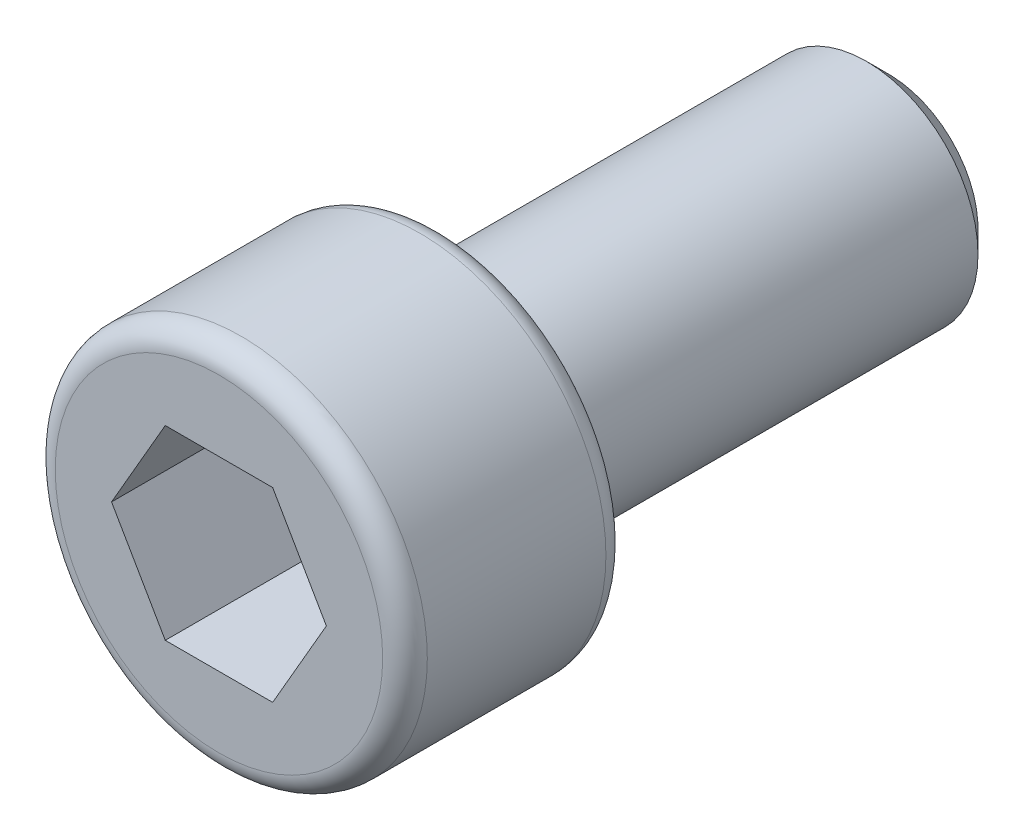
ISO-10303-21;
HEADER;
FILE_DESCRIPTION(('STEP AP214'),'2;1');
FILE_NAME('part.step','',(''),(''),'','','');
FILE_SCHEMA(('AUTOMOTIVE_DESIGN { 1 0 10303 214 1 1 1 1 }'));
ENDSEC;
DATA;
#1=APPLICATION_CONTEXT('core data for automotive mechanical design processes');
#2=APPLICATION_PROTOCOL_DEFINITION('international standard','automotive_design',2000,#1);
#3=PRODUCT_CONTEXT('',#1,'mechanical');
#4=PRODUCT('Part','Part','',(#3));
#5=PRODUCT_RELATED_PRODUCT_CATEGORY('part','',(#4));
#6=PRODUCT_DEFINITION_FORMATION('','',#4);
#7=PRODUCT_DEFINITION_CONTEXT('part definition',#1,'design');
#8=PRODUCT_DEFINITION('design','',#6,#7);
#9=PRODUCT_DEFINITION_SHAPE('','',#8);
#10=(LENGTH_UNIT() NAMED_UNIT(*) SI_UNIT(.MILLI.,.METRE.));
#11=(NAMED_UNIT(*) PLANE_ANGLE_UNIT() SI_UNIT($,.RADIAN.));
#12=(NAMED_UNIT(*) SI_UNIT($,.STERADIAN.) SOLID_ANGLE_UNIT());
#13=UNCERTAINTY_MEASURE_WITH_UNIT(LENGTH_MEASURE(1.E-05),#10,'distance_accuracy_value','');
#14=(GEOMETRIC_REPRESENTATION_CONTEXT(3) GLOBAL_UNCERTAINTY_ASSIGNED_CONTEXT((#13)) GLOBAL_UNIT_ASSIGNED_CONTEXT((#10,
#11,#12)) REPRESENTATION_CONTEXT('',''));
#15=CARTESIAN_POINT('',(0.,0.,0.));
#16=DIRECTION('',(0.,0.,1.));
#17=DIRECTION('',(1.,0.,0.));
#18=AXIS2_PLACEMENT_3D('',#15,#16,#17);
#19=CARTESIAN_POINT('',(0.,0.,3.));
#20=DIRECTION('',(0.,0.,-1.));
#21=DIRECTION('',(-1.,0.,0.));
#22=AXIS2_PLACEMENT_3D('',#19,#20,#21);
#23=CYLINDRICAL_SURFACE('',#22,2.5);
#24=CARTESIAN_POINT('',(0.,0.,0.3));
#25=DIRECTION('',(0.,0.,1.));
#26=DIRECTION('',(1.,0.,0.));
#27=AXIS2_PLACEMENT_3D('',#24,#25,#26);
#28=CIRCLE('',#27,2.5);
#29=CARTESIAN_POINT('',(2.5,0.,0.3));
#30=VERTEX_POINT('',#29);
#31=EDGE_CURVE('E154',#30,#30,#28,.T.);
#32=ORIENTED_EDGE('',*,*,#31,.T.);
#33=EDGE_LOOP('',(#32));
#34=FACE_BOUND('',#33,.T.);
#35=CARTESIAN_POINT('',(0.,0.,2.7));
#36=DIRECTION('',(0.,0.,1.));
#37=DIRECTION('',(1.,0.,0.));
#38=AXIS2_PLACEMENT_3D('',#35,#36,#37);
#39=CIRCLE('',#38,2.5);
#40=CARTESIAN_POINT('',(2.5,0.,2.7));
#41=VERTEX_POINT('',#40);
#42=EDGE_CURVE('E151',#41,#41,#39,.F.);
#43=ORIENTED_EDGE('',*,*,#42,.T.);
#44=EDGE_LOOP('',(#43));
#45=FACE_BOUND('',#44,.T.);
#46=ADVANCED_FACE('F35',(#34,#45),#23,.T.);
#47=CARTESIAN_POINT('',(0.,0.,3.));
#48=DIRECTION('',(0.,0.,1.));
#49=DIRECTION('',(1.,0.,0.));
#50=AXIS2_PLACEMENT_3D('',#47,#48,#49);
#51=PLANE('',#50);
#52=CARTESIAN_POINT('',(0.,0.,3.));
#53=DIRECTION('',(0.,0.,1.));
#54=DIRECTION('',(1.,0.,0.));
#55=AXIS2_PLACEMENT_3D('',#52,#53,#54);
#56=CIRCLE('',#55,2.2);
#57=CARTESIAN_POINT('',(2.2,0.,3.));
#58=VERTEX_POINT('',#57);
#59=EDGE_CURVE('E11',#58,#58,#56,.T.);
#60=ORIENTED_EDGE('',*,*,#59,.T.);
#61=EDGE_LOOP('',(#60));
#62=FACE_BOUND('',#61,.T.);
#63=DIRECTION('',(0.5,0.866025403784439,0.));
#64=VECTOR('',#63,1.);
#65=CARTESIAN_POINT('',(0.721687836487033,-1.25,3.));
#66=LINE('',#65,#64);
#67=CARTESIAN_POINT('',(0.721687836487033,-1.25,3.));
#68=VERTEX_POINT('',#67);
#69=CARTESIAN_POINT('',(1.44337567297406,0.,3.));
#70=VERTEX_POINT('',#69);
#71=EDGE_CURVE('E50',#68,#70,#66,.T.);
#72=ORIENTED_EDGE('',*,*,#71,.F.);
#73=DIRECTION('',(1.,0.,0.));
#74=VECTOR('',#73,1.);
#75=CARTESIAN_POINT('',(-0.721687836487032,-1.25,3.));
#76=LINE('',#75,#74);
#77=CARTESIAN_POINT('',(-0.721687836487032,-1.25,3.));
#78=VERTEX_POINT('',#77);
#79=EDGE_CURVE('E133',#78,#68,#76,.T.);
#80=ORIENTED_EDGE('',*,*,#79,.F.);
#81=DIRECTION('',(0.5,-0.866025403784438,0.));
#82=VECTOR('',#81,1.);
#83=CARTESIAN_POINT('',(-1.44337567297406,0.,3.));
#84=LINE('',#83,#82);
#85=CARTESIAN_POINT('',(-1.44337567297406,0.,3.));
#86=VERTEX_POINT('',#85);
#87=EDGE_CURVE('E131',#86,#78,#84,.T.);
#88=ORIENTED_EDGE('',*,*,#87,.F.);
#89=DIRECTION('',(-0.5,-0.866025403784439,0.));
#90=VECTOR('',#89,1.);
#91=CARTESIAN_POINT('',(-0.721687836487032,1.25,3.));
#92=LINE('',#91,#90);
#93=CARTESIAN_POINT('',(-0.721687836487032,1.25,3.));
#94=VERTEX_POINT('',#93);
#95=EDGE_CURVE('E98',#94,#86,#92,.T.);
#96=ORIENTED_EDGE('',*,*,#95,.F.);
#97=DIRECTION('',(-1.,0.,0.));
#98=VECTOR('',#97,1.);
#99=CARTESIAN_POINT('',(0.721687836487032,1.25,3.));
#100=LINE('',#99,#98);
#101=CARTESIAN_POINT('',(0.721687836487032,1.25,3.));
#102=VERTEX_POINT('',#101);
#103=EDGE_CURVE('E127',#102,#94,#100,.T.);
#104=ORIENTED_EDGE('',*,*,#103,.F.);
#105=DIRECTION('',(-0.5,0.866025403784439,0.));
#106=VECTOR('',#105,1.);
#107=CARTESIAN_POINT('',(1.44337567297406,0.,3.));
#108=LINE('',#107,#106);
#109=EDGE_CURVE('E124',#70,#102,#108,.T.);
#110=ORIENTED_EDGE('',*,*,#109,.F.);
#111=EDGE_LOOP('',(#72,#80,#88,#96,#104,#110));
#112=FACE_BOUND('',#111,.T.);
#113=ADVANCED_FACE('F170',(#62,#112),#51,.T.);
#114=CARTESIAN_POINT('',(0.,0.,0.));
#115=DIRECTION('',(0.,0.,1.));
#116=DIRECTION('',(1.,0.,0.));
#117=AXIS2_PLACEMENT_3D('',#114,#115,#116);
#118=PLANE('',#117);
#119=CARTESIAN_POINT('',(0.,0.,0.));
#120=DIRECTION('',(0.,0.,1.));
#121=DIRECTION('',(1.,0.,0.));
#122=AXIS2_PLACEMENT_3D('',#119,#120,#121);
#123=CIRCLE('',#122,2.2);
#124=CARTESIAN_POINT('',(2.2,0.,0.));
#125=VERTEX_POINT('',#124);
#126=EDGE_CURVE('E43',#125,#125,#123,.F.);
#127=ORIENTED_EDGE('',*,*,#126,.T.);
#128=EDGE_LOOP('',(#127));
#129=FACE_BOUND('',#128,.T.);
#130=CARTESIAN_POINT('',(0.,0.,0.));
#131=DIRECTION('',(0.,0.,-1.));
#132=DIRECTION('',(-1.,0.,0.));
#133=AXIS2_PLACEMENT_3D('',#130,#131,#132);
#134=CIRCLE('',#133,1.5);
#135=CARTESIAN_POINT('',(-1.5,0.,0.));
#136=VERTEX_POINT('',#135);
#137=EDGE_CURVE('E137',#136,#136,#134,.T.);
#138=ORIENTED_EDGE('',*,*,#137,.F.);
#139=EDGE_LOOP('',(#138));
#140=FACE_BOUND('',#139,.T.);
#141=ADVANCED_FACE('F159',(#129,#140),#118,.F.);
#142=CARTESIAN_POINT('',(0.,0.,-6.));
#143=DIRECTION('',(0.,0.,1.));
#144=DIRECTION('',(1.,0.,0.));
#145=AXIS2_PLACEMENT_3D('',#142,#143,#144);
#146=CYLINDRICAL_SURFACE('',#145,1.5);
#147=CARTESIAN_POINT('',(0.,0.,-5.7));
#148=DIRECTION('',(0.,0.,-1.));
#149=DIRECTION('',(-1.,0.,0.));
#150=AXIS2_PLACEMENT_3D('',#147,#148,#149);
#151=CIRCLE('',#150,1.5);
#152=CARTESIAN_POINT('',(-1.5,0.,-5.7));
#153=VERTEX_POINT('',#152);
#154=EDGE_CURVE('E148',#153,#153,#151,.F.);
#155=ORIENTED_EDGE('',*,*,#154,.T.);
#156=EDGE_LOOP('',(#155));
#157=FACE_BOUND('',#156,.T.);
#158=ORIENTED_EDGE('',*,*,#137,.T.);
#159=EDGE_LOOP('',(#158));
#160=FACE_BOUND('',#159,.T.);
#161=ADVANCED_FACE('F197',(#157,#160),#146,.T.);
#162=CARTESIAN_POINT('',(0.,0.,-6.));
#163=DIRECTION('',(0.,0.,-1.));
#164=DIRECTION('',(-1.,0.,0.));
#165=AXIS2_PLACEMENT_3D('',#162,#163,#164);
#166=PLANE('',#165);
#167=CARTESIAN_POINT('',(0.,0.,-6.));
#168=DIRECTION('',(0.,0.,-1.));
#169=DIRECTION('',(-1.,0.,0.));
#170=AXIS2_PLACEMENT_3D('',#167,#168,#169);
#171=CIRCLE('',#170,1.2);
#172=CARTESIAN_POINT('',(-1.2,0.,-6.));
#173=VERTEX_POINT('',#172);
#174=EDGE_CURVE('E145',#173,#173,#171,.T.);
#175=ORIENTED_EDGE('',*,*,#174,.T.);
#176=EDGE_LOOP('',(#175));
#177=FACE_BOUND('',#176,.T.);
#178=ADVANCED_FACE('F190',(#177),#166,.T.);
#179=CARTESIAN_POINT('',(0.721687836487033,-1.25,1.));
#180=DIRECTION('',(0.866025403784439,-0.5,0.));
#181=DIRECTION('',(0.5,0.866025403784439,0.));
#182=AXIS2_PLACEMENT_3D('',#179,#180,#181);
#183=PLANE('',#182);
#184=ORIENTED_EDGE('',*,*,#71,.T.);
#185=DIRECTION('',(0.,0.,1.));
#186=VECTOR('',#185,1.);
#187=CARTESIAN_POINT('',(1.44337567297406,0.,1.));
#188=LINE('',#187,#186);
#189=CARTESIAN_POINT('',(1.44337567297406,0.,1.));
#190=VERTEX_POINT('',#189);
#191=EDGE_CURVE('E80',#190,#70,#188,.T.);
#192=ORIENTED_EDGE('',*,*,#191,.F.);
#193=DIRECTION('',(0.5,0.866025403784439,0.));
#194=VECTOR('',#193,1.);
#195=CARTESIAN_POINT('',(0.721687836487033,-1.25,1.));
#196=LINE('',#195,#194);
#197=CARTESIAN_POINT('',(0.721687836487033,-1.25,1.));
#198=VERTEX_POINT('',#197);
#199=EDGE_CURVE('E135',#198,#190,#196,.T.);
#200=ORIENTED_EDGE('',*,*,#199,.F.);
#201=DIRECTION('',(0.,0.,1.));
#202=VECTOR('',#201,1.);
#203=CARTESIAN_POINT('',(0.721687836487033,-1.25,1.));
#204=LINE('',#203,#202);
#205=EDGE_CURVE('E58',#198,#68,#204,.T.);
#206=ORIENTED_EDGE('',*,*,#205,.T.);
#207=EDGE_LOOP('',(#184,#192,#200,#206));
#208=FACE_BOUND('',#207,.T.);
#209=ADVANCED_FACE('F187',(#208),#183,.F.);
#210=CARTESIAN_POINT('',(-0.721687836487032,-1.25,1.));
#211=DIRECTION('',(0.,-1.,0.));
#212=DIRECTION('',(0.,0.,-1.));
#213=AXIS2_PLACEMENT_3D('',#210,#211,#212);
#214=PLANE('',#213);
#215=ORIENTED_EDGE('',*,*,#79,.T.);
#216=ORIENTED_EDGE('',*,*,#205,.F.);
#217=DIRECTION('',(1.,0.,0.));
#218=VECTOR('',#217,1.);
#219=CARTESIAN_POINT('',(-0.721687836487032,-1.25,1.));
#220=LINE('',#219,#218);
#221=CARTESIAN_POINT('',(-0.721687836487032,-1.25,1.));
#222=VERTEX_POINT('',#221);
#223=EDGE_CURVE('E110',#222,#198,#220,.T.);
#224=ORIENTED_EDGE('',*,*,#223,.F.);
#225=DIRECTION('',(0.,0.,1.));
#226=VECTOR('',#225,1.);
#227=CARTESIAN_POINT('',(-0.721687836487032,-1.25,1.));
#228=LINE('',#227,#226);
#229=EDGE_CURVE('E102',#222,#78,#228,.T.);
#230=ORIENTED_EDGE('',*,*,#229,.T.);
#231=EDGE_LOOP('',(#215,#216,#224,#230));
#232=FACE_BOUND('',#231,.T.);
#233=ADVANCED_FACE('F189',(#232),#214,.F.);
#234=CARTESIAN_POINT('',(-1.44337567297406,0.,1.));
#235=DIRECTION('',(-0.866025403784438,-0.5,0.));
#236=DIRECTION('',(0.5,-0.866025403784438,0.));
#237=AXIS2_PLACEMENT_3D('',#234,#235,#236);
#238=PLANE('',#237);
#239=ORIENTED_EDGE('',*,*,#87,.T.);
#240=ORIENTED_EDGE('',*,*,#229,.F.);
#241=DIRECTION('',(0.5,-0.866025403784438,0.));
#242=VECTOR('',#241,1.);
#243=CARTESIAN_POINT('',(-1.44337567297406,0.,1.));
#244=LINE('',#243,#242);
#245=CARTESIAN_POINT('',(-1.44337567297406,0.,1.));
#246=VERTEX_POINT('',#245);
#247=EDGE_CURVE('E106',#246,#222,#244,.T.);
#248=ORIENTED_EDGE('',*,*,#247,.F.);
#249=DIRECTION('',(0.,0.,1.));
#250=VECTOR('',#249,1.);
#251=CARTESIAN_POINT('',(-1.44337567297406,0.,1.));
#252=LINE('',#251,#250);
#253=EDGE_CURVE('E91',#246,#86,#252,.T.);
#254=ORIENTED_EDGE('',*,*,#253,.T.);
#255=EDGE_LOOP('',(#239,#240,#248,#254));
#256=FACE_BOUND('',#255,.T.);
#257=ADVANCED_FACE('F107',(#256),#238,.F.);
#258=CARTESIAN_POINT('',(-0.721687836487032,1.25,1.));
#259=DIRECTION('',(-0.866025403784439,0.5,0.));
#260=DIRECTION('',(-0.5,-0.866025403784439,0.));
#261=AXIS2_PLACEMENT_3D('',#258,#259,#260);
#262=PLANE('',#261);
#263=ORIENTED_EDGE('',*,*,#95,.T.);
#264=ORIENTED_EDGE('',*,*,#253,.F.);
#265=DIRECTION('',(-0.5,-0.866025403784439,0.));
#266=VECTOR('',#265,1.);
#267=CARTESIAN_POINT('',(-0.721687836487032,1.25,1.));
#268=LINE('',#267,#266);
#269=CARTESIAN_POINT('',(-0.721687836487032,1.25,1.));
#270=VERTEX_POINT('',#269);
#271=EDGE_CURVE('E95',#270,#246,#268,.T.);
#272=ORIENTED_EDGE('',*,*,#271,.F.);
#273=DIRECTION('',(0.,0.,1.));
#274=VECTOR('',#273,1.);
#275=CARTESIAN_POINT('',(-0.721687836487032,1.25,1.));
#276=LINE('',#275,#274);
#277=EDGE_CURVE('E103',#270,#94,#276,.T.);
#278=ORIENTED_EDGE('',*,*,#277,.T.);
#279=EDGE_LOOP('',(#263,#264,#272,#278));
#280=FACE_BOUND('',#279,.T.);
#281=ADVANCED_FACE('F93',(#280),#262,.F.);
#282=CARTESIAN_POINT('',(0.721687836487032,1.25,1.));
#283=DIRECTION('',(0.,1.,0.));
#284=DIRECTION('',(0.,0.,1.));
#285=AXIS2_PLACEMENT_3D('',#282,#283,#284);
#286=PLANE('',#285);
#287=ORIENTED_EDGE('',*,*,#103,.T.);
#288=ORIENTED_EDGE('',*,*,#277,.F.);
#289=DIRECTION('',(-1.,0.,0.));
#290=VECTOR('',#289,1.);
#291=CARTESIAN_POINT('',(0.721687836487032,1.25,1.));
#292=LINE('',#291,#290);
#293=CARTESIAN_POINT('',(0.721687836487032,1.25,1.));
#294=VERTEX_POINT('',#293);
#295=EDGE_CURVE('E116',#294,#270,#292,.T.);
#296=ORIENTED_EDGE('',*,*,#295,.F.);
#297=DIRECTION('',(0.,0.,1.));
#298=VECTOR('',#297,1.);
#299=CARTESIAN_POINT('',(0.721687836487032,1.25,1.));
#300=LINE('',#299,#298);
#301=EDGE_CURVE('E140',#294,#102,#300,.T.);
#302=ORIENTED_EDGE('',*,*,#301,.T.);
#303=EDGE_LOOP('',(#287,#288,#296,#302));
#304=FACE_BOUND('',#303,.T.);
#305=ADVANCED_FACE('F225',(#304),#286,.F.);
#306=CARTESIAN_POINT('',(1.44337567297406,0.,1.));
#307=DIRECTION('',(0.866025403784438,0.5,0.));
#308=DIRECTION('',(-0.5,0.866025403784439,0.));
#309=AXIS2_PLACEMENT_3D('',#306,#307,#308);
#310=PLANE('',#309);
#311=ORIENTED_EDGE('',*,*,#109,.T.);
#312=ORIENTED_EDGE('',*,*,#301,.F.);
#313=DIRECTION('',(-0.5,0.866025403784439,0.));
#314=VECTOR('',#313,1.);
#315=CARTESIAN_POINT('',(1.44337567297406,0.,1.));
#316=LINE('',#315,#314);
#317=EDGE_CURVE('E118',#190,#294,#316,.T.);
#318=ORIENTED_EDGE('',*,*,#317,.F.);
#319=ORIENTED_EDGE('',*,*,#191,.T.);
#320=EDGE_LOOP('',(#311,#312,#318,#319));
#321=FACE_BOUND('',#320,.T.);
#322=ADVANCED_FACE('F185',(#321),#310,.F.);
#323=CARTESIAN_POINT('',(0.,0.,1.));
#324=DIRECTION('',(0.,0.,1.));
#325=DIRECTION('',(1.,0.,0.));
#326=AXIS2_PLACEMENT_3D('',#323,#324,#325);
#327=PLANE('',#326);
#328=ORIENTED_EDGE('',*,*,#199,.T.);
#329=ORIENTED_EDGE('',*,*,#317,.T.);
#330=ORIENTED_EDGE('',*,*,#295,.T.);
#331=ORIENTED_EDGE('',*,*,#271,.T.);
#332=ORIENTED_EDGE('',*,*,#247,.T.);
#333=ORIENTED_EDGE('',*,*,#223,.T.);
#334=EDGE_LOOP('',(#328,#329,#330,#331,#332,#333));
#335=FACE_BOUND('',#334,.T.);
#336=ADVANCED_FACE('F113',(#335),#327,.T.);
#337=CARTESIAN_POINT('',(0.,0.,-6.));
#338=DIRECTION('',(0.,0.,1.));
#339=DIRECTION('',(1.,0.,0.));
#340=AXIS2_PLACEMENT_3D('',#337,#338,#339);
#341=CONICAL_SURFACE('',#340,1.2,0.785398163397444);
#342=ORIENTED_EDGE('',*,*,#154,.F.);
#343=EDGE_LOOP('',(#342));
#344=FACE_BOUND('',#343,.T.);
#345=ORIENTED_EDGE('',*,*,#174,.F.);
#346=EDGE_LOOP('',(#345));
#347=FACE_BOUND('',#346,.T.);
#348=ADVANCED_FACE('F165',(#344,#347),#341,.T.);
#349=CARTESIAN_POINT('',(0.,0.,0.3));
#350=DIRECTION('',(0.,0.,1.));
#351=DIRECTION('',(1.,0.,0.));
#352=AXIS2_PLACEMENT_3D('',#349,#350,#351);
#353=TOROIDAL_SURFACE('',#352,2.2,0.3);
#354=ORIENTED_EDGE('',*,*,#126,.F.);
#355=EDGE_LOOP('',(#354));
#356=FACE_BOUND('',#355,.T.);
#357=ORIENTED_EDGE('',*,*,#31,.F.);
#358=EDGE_LOOP('',(#357));
#359=FACE_BOUND('',#358,.T.);
#360=ADVANCED_FACE('F162',(#356,#359),#353,.T.);
#361=CARTESIAN_POINT('',(0.,0.,2.7));
#362=DIRECTION('',(0.,0.,1.));
#363=DIRECTION('',(1.,0.,0.));
#364=AXIS2_PLACEMENT_3D('',#361,#362,#363);
#365=TOROIDAL_SURFACE('',#364,2.2,0.3);
#366=ORIENTED_EDGE('',*,*,#42,.F.);
#367=EDGE_LOOP('',(#366));
#368=FACE_BOUND('',#367,.T.);
#369=ORIENTED_EDGE('',*,*,#59,.F.);
#370=EDGE_LOOP('',(#369));
#371=FACE_BOUND('',#370,.T.);
#372=ADVANCED_FACE('F37',(#368,#371),#365,.T.);
#373=CLOSED_SHELL('',(#46,#113,#141,#161,#178,#209,#233,#257,#281,#305,#322,#336,#348,#360,#372));
#374=MANIFOLD_SOLID_BREP('B2',#373);
#375=ADVANCED_BREP_SHAPE_REPRESENTATION('',(#18,#374),#14);
#376=SHAPE_DEFINITION_REPRESENTATION(#9,#375);
ENDSEC;
END-ISO-10303-21;
